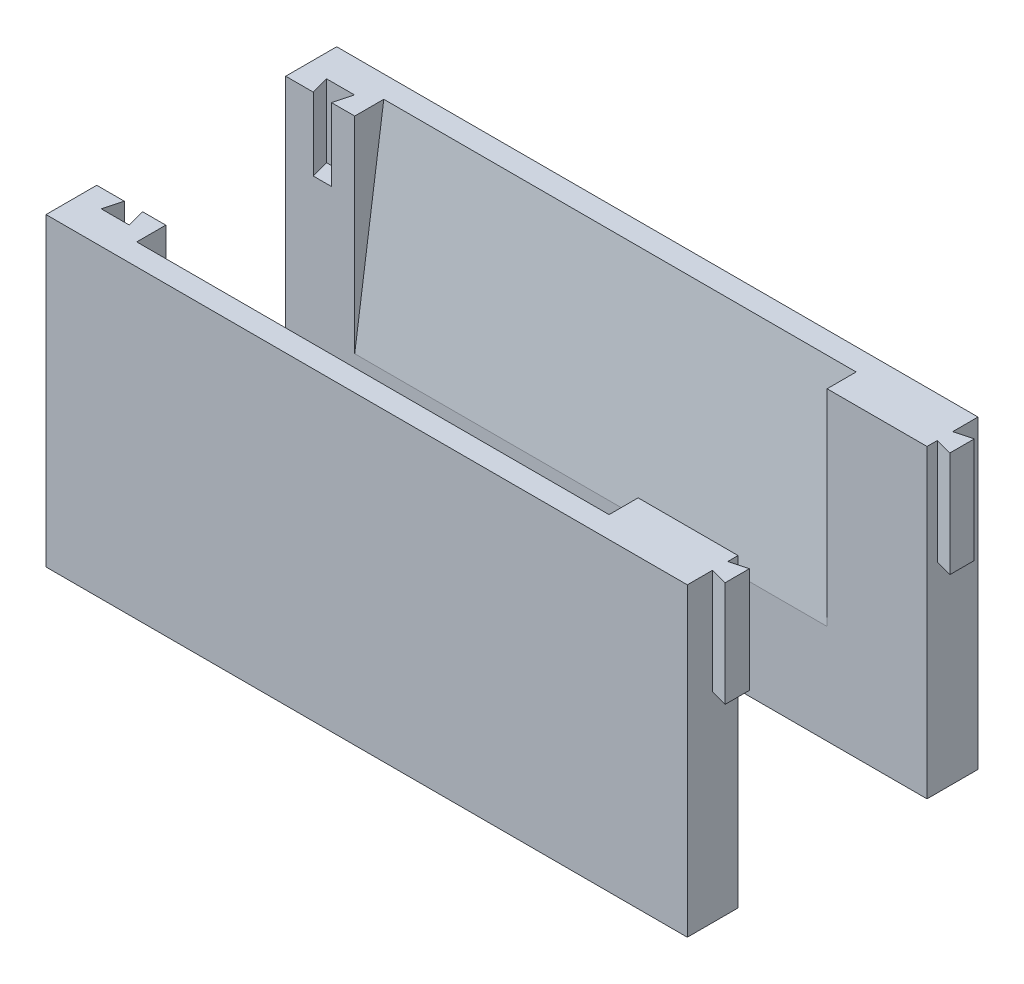
ISO-10303-21;
HEADER;
FILE_DESCRIPTION(('STEP AP214'),'2;1');
FILE_NAME('part.step','',(''),(''),'','','');
FILE_SCHEMA(('AUTOMOTIVE_DESIGN { 1 0 10303 214 1 1 1 1 }'));
ENDSEC;
DATA;
#1=APPLICATION_CONTEXT('core data for automotive mechanical design processes');
#2=APPLICATION_PROTOCOL_DEFINITION('international standard','automotive_design',2000,#1);
#3=PRODUCT_CONTEXT('',#1,'mechanical');
#4=PRODUCT('Part','Part','',(#3));
#5=PRODUCT_RELATED_PRODUCT_CATEGORY('part','',(#4));
#6=PRODUCT_DEFINITION_FORMATION('','',#4);
#7=PRODUCT_DEFINITION_CONTEXT('part definition',#1,'design');
#8=PRODUCT_DEFINITION('design','',#6,#7);
#9=PRODUCT_DEFINITION_SHAPE('','',#8);
#10=(LENGTH_UNIT() NAMED_UNIT(*) SI_UNIT(.MILLI.,.METRE.));
#11=(NAMED_UNIT(*) PLANE_ANGLE_UNIT() SI_UNIT($,.RADIAN.));
#12=(NAMED_UNIT(*) SI_UNIT($,.STERADIAN.) SOLID_ANGLE_UNIT());
#13=UNCERTAINTY_MEASURE_WITH_UNIT(LENGTH_MEASURE(1.E-05),#10,'distance_accuracy_value','');
#14=(GEOMETRIC_REPRESENTATION_CONTEXT(3) GLOBAL_UNCERTAINTY_ASSIGNED_CONTEXT((#13)) GLOBAL_UNIT_ASSIGNED_CONTEXT((#10,
#11,#12)) REPRESENTATION_CONTEXT('',''));
#15=CARTESIAN_POINT('',(0.,0.,0.));
#16=DIRECTION('',(0.,0.,1.));
#17=DIRECTION('',(1.,0.,0.));
#18=AXIS2_PLACEMENT_3D('',#15,#16,#17);
#19=CARTESIAN_POINT('',(0.,0.,-26.));
#20=DIRECTION('',(0.,0.,-1.));
#21=DIRECTION('',(1.,0.,0.));
#22=AXIS2_PLACEMENT_3D('',#19,#20,#21);
#23=PLANE('',#22);
#24=DIRECTION('',(0.,-1.,0.));
#25=VECTOR('',#24,1.);
#26=CARTESIAN_POINT('',(32.5489745050857,0.,-26.));
#27=LINE('',#26,#25);
#28=CARTESIAN_POINT('',(32.5489745050857,14.0482922625164,-26.));
#29=VERTEX_POINT('',#28);
#30=CARTESIAN_POINT('',(32.5489745050857,-14.2755129023587,-26.));
#31=VERTEX_POINT('',#30);
#32=EDGE_CURVE('E199',#29,#31,#27,.T.);
#33=ORIENTED_EDGE('',*,*,#32,.T.);
#34=DIRECTION('',(1.,0.,0.));
#35=VECTOR('',#34,1.);
#36=CARTESIAN_POINT('',(0.,-14.2755129023587,-26.));
#37=LINE('',#36,#35);
#38=CARTESIAN_POINT('',(-32.4510254949143,-14.2755129023587,-26.));
#39=VERTEX_POINT('',#38);
#40=EDGE_CURVE('E202',#39,#31,#37,.T.);
#41=ORIENTED_EDGE('',*,*,#40,.F.);
#42=DIRECTION('',(0.,-1.,0.));
#43=VECTOR('',#42,1.);
#44=CARTESIAN_POINT('',(-32.4510254949143,0.,-26.));
#45=LINE('',#44,#43);
#46=CARTESIAN_POINT('',(-32.4510254949143,14.0482922625164,-26.));
#47=VERTEX_POINT('',#46);
#48=EDGE_CURVE('E197',#47,#39,#45,.T.);
#49=ORIENTED_EDGE('',*,*,#48,.F.);
#50=DIRECTION('',(-1.,0.,0.));
#51=VECTOR('',#50,1.);
#52=CARTESIAN_POINT('',(-41.9510254949143,14.0482922625164,-26.));
#53=LINE('',#52,#51);
#54=CARTESIAN_POINT('',(-35.6510254949143,14.0482922625164,-26.));
#55=VERTEX_POINT('',#54);
#56=EDGE_CURVE('E269',#47,#55,#53,.T.);
#57=ORIENTED_EDGE('',*,*,#56,.T.);
#58=DIRECTION('',(0.,-1.,0.));
#59=VECTOR('',#58,1.);
#60=CARTESIAN_POINT('',(-35.6510254949143,188.876376348919,-26.));
#61=LINE('',#60,#59);
#62=CARTESIAN_POINT('',(-35.6510254949143,4.04829226251643,-26.));
#63=VERTEX_POINT('',#62);
#64=EDGE_CURVE('E252',#55,#63,#61,.T.);
#65=ORIENTED_EDGE('',*,*,#64,.T.);
#66=DIRECTION('',(-1.,0.,0.));
#67=VECTOR('',#66,1.);
#68=CARTESIAN_POINT('',(-41.9510254949143,4.04829226251643,-26.));
#69=LINE('',#68,#67);
#70=CARTESIAN_POINT('',(-38.1510254949143,4.04829226251643,-26.));
#71=VERTEX_POINT('',#70);
#72=EDGE_CURVE('E224',#63,#71,#69,.T.);
#73=ORIENTED_EDGE('',*,*,#72,.T.);
#74=DIRECTION('',(0.,-1.,0.));
#75=VECTOR('',#74,1.);
#76=CARTESIAN_POINT('',(-38.1510254949143,188.876376348919,-26.));
#77=LINE('',#76,#75);
#78=CARTESIAN_POINT('',(-38.1510254949143,14.0482922625164,-26.));
#79=VERTEX_POINT('',#78);
#80=EDGE_CURVE('E233',#79,#71,#77,.T.);
#81=ORIENTED_EDGE('',*,*,#80,.F.);
#82=CARTESIAN_POINT('',(-41.9510254949143,14.0482922625164,-26.));
#83=VERTEX_POINT('',#82);
#84=EDGE_CURVE('E267',#79,#83,#53,.T.);
#85=ORIENTED_EDGE('',*,*,#84,.T.);
#86=DIRECTION('',(0.,-1.,0.));
#87=VECTOR('',#86,1.);
#88=CARTESIAN_POINT('',(-41.9510254949143,14.0482922625164,-26.));
#89=LINE('',#88,#87);
#90=CARTESIAN_POINT('',(-41.9510254949143,-27.9517077374836,-26.));
#91=VERTEX_POINT('',#90);
#92=EDGE_CURVE('E162',#83,#91,#89,.T.);
#93=ORIENTED_EDGE('',*,*,#92,.T.);
#94=DIRECTION('',(1.,0.,0.));
#95=VECTOR('',#94,1.);
#96=CARTESIAN_POINT('',(-41.9510254949143,-27.9517077374836,-26.));
#97=LINE('',#96,#95);
#98=CARTESIAN_POINT('',(46.2989745050857,-27.9517077374836,-26.));
#99=VERTEX_POINT('',#98);
#100=EDGE_CURVE('E261',#91,#99,#97,.T.);
#101=ORIENTED_EDGE('',*,*,#100,.T.);
#102=DIRECTION('',(0.,1.,0.));
#103=VECTOR('',#102,1.);
#104=CARTESIAN_POINT('',(46.2989745050857,14.0482922625164,-26.));
#105=LINE('',#104,#103);
#106=CARTESIAN_POINT('',(46.2989745050857,14.0482922625164,-26.));
#107=VERTEX_POINT('',#106);
#108=EDGE_CURVE('E264',#99,#107,#105,.T.);
#109=ORIENTED_EDGE('',*,*,#108,.T.);
#110=EDGE_CURVE('E168',#107,#29,#53,.T.);
#111=ORIENTED_EDGE('',*,*,#110,.T.);
#112=EDGE_LOOP('',(#33,#41,#49,#57,#65,#73,#81,#85,#93,#101,#109,#111));
#113=FACE_BOUND('',#112,.T.);
#114=ADVANCED_FACE('F49',(#113),#23,.F.);
#115=CARTESIAN_POINT('',(-41.9510254949143,14.0482922625164,-31.));
#116=DIRECTION('',(0.,-1.,0.));
#117=DIRECTION('',(0.,0.,1.));
#118=AXIS2_PLACEMENT_3D('',#115,#116,#117);
#119=PLANE('',#118);
#120=DIRECTION('',(0.,0.,1.));
#121=VECTOR('',#120,1.);
#122=CARTESIAN_POINT('',(32.5489745050857,14.0482922625164,-26.));
#123=LINE('',#122,#121);
#124=CARTESIAN_POINT('',(32.5489745050857,14.0482922625164,-30.));
#125=VERTEX_POINT('',#124);
#126=EDGE_CURVE('E191',#125,#29,#123,.T.);
#127=ORIENTED_EDGE('',*,*,#126,.T.);
#128=ORIENTED_EDGE('',*,*,#110,.F.);
#129=DIRECTION('',(0.,0.,1.));
#130=VECTOR('',#129,1.);
#131=CARTESIAN_POINT('',(46.2989745050857,14.0482922625164,-31.));
#132=LINE('',#131,#130);
#133=CARTESIAN_POINT('',(46.2989745050857,14.0482922625164,-27.42));
#134=VERTEX_POINT('',#133);
#135=EDGE_CURVE('E167',#134,#107,#132,.T.);
#136=ORIENTED_EDGE('',*,*,#135,.F.);
#137=DIRECTION('',(-0.965925826289067,0.,-0.258819045102525));
#138=VECTOR('',#137,1.);
#139=CARTESIAN_POINT('',(48.6489745050857,14.0482922625164,-26.7903193977868));
#140=LINE('',#139,#138);
#141=CARTESIAN_POINT('',(48.6489745050857,14.0482922625164,-26.7903193977868));
#142=VERTEX_POINT('',#141);
#143=EDGE_CURVE('E210',#142,#134,#140,.T.);
#144=ORIENTED_EDGE('',*,*,#143,.F.);
#145=DIRECTION('',(0.,0.,1.));
#146=VECTOR('',#145,1.);
#147=CARTESIAN_POINT('',(48.6489745050857,14.0482922625164,-30.1496806022131));
#148=LINE('',#147,#146);
#149=CARTESIAN_POINT('',(48.6489745050857,14.0482922625164,-30.1496806022131));
#150=VERTEX_POINT('',#149);
#151=EDGE_CURVE('E217',#150,#142,#148,.T.);
#152=ORIENTED_EDGE('',*,*,#151,.F.);
#153=DIRECTION('',(0.965925826289067,0.,-0.258819045102525));
#154=VECTOR('',#153,1.);
#155=CARTESIAN_POINT('',(46.2989745050857,14.0482922625164,-29.52));
#156=LINE('',#155,#154);
#157=CARTESIAN_POINT('',(46.2989745050857,14.0482922625164,-29.52));
#158=VERTEX_POINT('',#157);
#159=EDGE_CURVE('E205',#158,#150,#156,.T.);
#160=ORIENTED_EDGE('',*,*,#159,.F.);
#161=CARTESIAN_POINT('',(46.2989745050857,14.0482922625164,-33.0175));
#162=VERTEX_POINT('',#161);
#163=EDGE_CURVE('E181',#162,#158,#132,.T.);
#164=ORIENTED_EDGE('',*,*,#163,.F.);
#165=DIRECTION('',(-1.,0.,0.));
#166=VECTOR('',#165,1.);
#167=CARTESIAN_POINT('',(-41.9510254949143,14.0482922625164,-33.0175));
#168=LINE('',#167,#166);
#169=CARTESIAN_POINT('',(-41.9510254949143,14.0482922625164,-33.0175));
#170=VERTEX_POINT('',#169);
#171=EDGE_CURVE('E174',#162,#170,#168,.T.);
#172=ORIENTED_EDGE('',*,*,#171,.T.);
#173=DIRECTION('',(0.,0.,1.));
#174=VECTOR('',#173,1.);
#175=CARTESIAN_POINT('',(-41.9510254949143,14.0482922625164,-31.));
#176=LINE('',#175,#174);
#177=EDGE_CURVE('E157',#170,#83,#176,.T.);
#178=ORIENTED_EDGE('',*,*,#177,.T.);
#179=ORIENTED_EDGE('',*,*,#84,.F.);
#180=DIRECTION('',(0.258819045102517,0.,0.965925826289069));
#181=VECTOR('',#180,1.);
#182=CARTESIAN_POINT('',(-38.1510254949143,14.0482922625164,-26.));
#183=LINE('',#182,#181);
#184=CARTESIAN_POINT('',(-38.8208984759921,14.0482922625164,-28.5));
#185=VERTEX_POINT('',#184);
#186=EDGE_CURVE('E237',#185,#79,#183,.T.);
#187=ORIENTED_EDGE('',*,*,#186,.F.);
#188=DIRECTION('',(-1.,0.,0.));
#189=VECTOR('',#188,1.);
#190=CARTESIAN_POINT('',(-38.8208984759921,14.0482922625164,-28.5));
#191=LINE('',#190,#189);
#192=CARTESIAN_POINT('',(-34.9811525138365,14.0482922625164,-28.5));
#193=VERTEX_POINT('',#192);
#194=EDGE_CURVE('E243',#193,#185,#191,.T.);
#195=ORIENTED_EDGE('',*,*,#194,.F.);
#196=DIRECTION('',(0.258819045102517,0.,-0.965925826289069));
#197=VECTOR('',#196,1.);
#198=CARTESIAN_POINT('',(-34.9811525138365,14.0482922625164,-28.5));
#199=LINE('',#198,#197);
#200=EDGE_CURVE('E240',#55,#193,#199,.T.);
#201=ORIENTED_EDGE('',*,*,#200,.F.);
#202=ORIENTED_EDGE('',*,*,#56,.F.);
#203=DIRECTION('',(0.,0.,1.));
#204=VECTOR('',#203,1.);
#205=CARTESIAN_POINT('',(-32.4510254949143,14.0482922625164,-26.));
#206=LINE('',#205,#204);
#207=CARTESIAN_POINT('',(-32.4510254949143,14.0482922625164,-30.));
#208=VERTEX_POINT('',#207);
#209=EDGE_CURVE('E64',#208,#47,#206,.T.);
#210=ORIENTED_EDGE('',*,*,#209,.F.);
#211=DIRECTION('',(-1.,0.,0.));
#212=VECTOR('',#211,1.);
#213=CARTESIAN_POINT('',(32.5489745050857,14.0482922625164,-30.));
#214=LINE('',#213,#212);
#215=EDGE_CURVE('E192',#125,#208,#214,.T.);
#216=ORIENTED_EDGE('',*,*,#215,.F.);
#217=EDGE_LOOP('',(#127,#128,#136,#144,#152,#160,#164,#172,#178,#179,#187,#195,#201,#202,#210,#216));
#218=FACE_BOUND('',#217,.T.);
#219=ADVANCED_FACE('F179',(#218),#119,.F.);
#220=CARTESIAN_POINT('',(46.2989745050857,14.0482922625164,-31.));
#221=DIRECTION('',(-1.,0.,0.));
#222=DIRECTION('',(0.,0.,-1.));
#223=AXIS2_PLACEMENT_3D('',#220,#221,#222);
#224=PLANE('',#223);
#225=DIRECTION('',(0.,1.,0.));
#226=VECTOR('',#225,1.);
#227=CARTESIAN_POINT('',(46.2989745050857,-0.451707737483568,-27.42));
#228=LINE('',#227,#226);
#229=CARTESIAN_POINT('',(46.2989745050857,-0.451707737483568,-27.42));
#230=VERTEX_POINT('',#229);
#231=EDGE_CURVE('E222',#230,#134,#228,.T.);
#232=ORIENTED_EDGE('',*,*,#231,.T.);
#233=ORIENTED_EDGE('',*,*,#135,.T.);
#234=ORIENTED_EDGE('',*,*,#108,.F.);
#235=DIRECTION('',(0.,0.,1.));
#236=VECTOR('',#235,1.);
#237=CARTESIAN_POINT('',(46.2989745050857,-27.9517077374836,-31.));
#238=LINE('',#237,#236);
#239=CARTESIAN_POINT('',(46.2989745050857,-27.9517077374836,-33.0175));
#240=VERTEX_POINT('',#239);
#241=EDGE_CURVE('E57',#240,#99,#238,.T.);
#242=ORIENTED_EDGE('',*,*,#241,.F.);
#243=DIRECTION('',(0.,1.,0.));
#244=VECTOR('',#243,1.);
#245=CARTESIAN_POINT('',(46.2989745050857,-27.9517077374836,-33.0175));
#246=LINE('',#245,#244);
#247=EDGE_CURVE('E177',#240,#162,#246,.T.);
#248=ORIENTED_EDGE('',*,*,#247,.T.);
#249=ORIENTED_EDGE('',*,*,#163,.T.);
#250=DIRECTION('',(0.,1.,0.));
#251=VECTOR('',#250,1.);
#252=CARTESIAN_POINT('',(46.2989745050857,-0.451707737483568,-29.52));
#253=LINE('',#252,#251);
#254=CARTESIAN_POINT('',(46.2989745050857,-0.451707737483568,-29.52));
#255=VERTEX_POINT('',#254);
#256=EDGE_CURVE('E72',#255,#158,#253,.T.);
#257=ORIENTED_EDGE('',*,*,#256,.F.);
#258=DIRECTION('',(0.,0.,-1.));
#259=VECTOR('',#258,1.);
#260=CARTESIAN_POINT('',(46.2989745050857,-0.451707737483568,-27.42));
#261=LINE('',#260,#259);
#262=EDGE_CURVE('E206',#230,#255,#261,.T.);
#263=ORIENTED_EDGE('',*,*,#262,.F.);
#264=EDGE_LOOP('',(#232,#233,#234,#242,#248,#249,#257,#263));
#265=FACE_BOUND('',#264,.T.);
#266=ADVANCED_FACE('F276',(#265),#224,.F.);
#267=CARTESIAN_POINT('',(-41.9510254949143,14.0482922625164,-31.));
#268=DIRECTION('',(1.,0.,0.));
#269=DIRECTION('',(0.,0.,1.));
#270=AXIS2_PLACEMENT_3D('',#267,#268,#269);
#271=PLANE('',#270);
#272=ORIENTED_EDGE('',*,*,#92,.F.);
#273=ORIENTED_EDGE('',*,*,#177,.F.);
#274=DIRECTION('',(0.,1.,0.));
#275=VECTOR('',#274,1.);
#276=CARTESIAN_POINT('',(-41.9510254949143,-27.9517077374836,-33.0175));
#277=LINE('',#276,#275);
#278=CARTESIAN_POINT('',(-41.9510254949143,-27.9517077374836,-33.0175));
#279=VERTEX_POINT('',#278);
#280=EDGE_CURVE('E159',#279,#170,#277,.T.);
#281=ORIENTED_EDGE('',*,*,#280,.F.);
#282=DIRECTION('',(0.,0.,1.));
#283=VECTOR('',#282,1.);
#284=CARTESIAN_POINT('',(-41.9510254949143,-27.9517077374836,-31.));
#285=LINE('',#284,#283);
#286=EDGE_CURVE('E12',#279,#91,#285,.T.);
#287=ORIENTED_EDGE('',*,*,#286,.T.);
#288=EDGE_LOOP('',(#272,#273,#281,#287));
#289=FACE_BOUND('',#288,.T.);
#290=ADVANCED_FACE('F51',(#289),#271,.F.);
#291=CARTESIAN_POINT('',(-41.9510254949143,-27.9517077374836,-31.));
#292=DIRECTION('',(0.,1.,0.));
#293=DIRECTION('',(0.,0.,-1.));
#294=AXIS2_PLACEMENT_3D('',#291,#292,#293);
#295=PLANE('',#294);
#296=ORIENTED_EDGE('',*,*,#100,.F.);
#297=ORIENTED_EDGE('',*,*,#286,.F.);
#298=DIRECTION('',(-1.,0.,0.));
#299=VECTOR('',#298,1.);
#300=CARTESIAN_POINT('',(-41.9510254949143,-27.9517077374836,-33.0175));
#301=LINE('',#300,#299);
#302=EDGE_CURVE('E176',#240,#279,#301,.T.);
#303=ORIENTED_EDGE('',*,*,#302,.F.);
#304=ORIENTED_EDGE('',*,*,#241,.T.);
#305=EDGE_LOOP('',(#296,#297,#303,#304));
#306=FACE_BOUND('',#305,.T.);
#307=ADVANCED_FACE('F274',(#306),#295,.F.);
#308=CARTESIAN_POINT('',(-34.9811525138365,188.876376348919,-28.5));
#309=DIRECTION('',(-0.965925826289069,0.,-0.258819045102517));
#310=DIRECTION('',(0.258819045102517,0.,-0.965925826289069));
#311=AXIS2_PLACEMENT_3D('',#308,#309,#310);
#312=PLANE('',#311);
#313=ORIENTED_EDGE('',*,*,#200,.T.);
#314=DIRECTION('',(0.,-1.,0.));
#315=VECTOR('',#314,1.);
#316=CARTESIAN_POINT('',(-34.9811525138365,188.876376348919,-28.5));
#317=LINE('',#316,#315);
#318=CARTESIAN_POINT('',(-34.9811525138365,4.04829226251643,-28.5));
#319=VERTEX_POINT('',#318);
#320=EDGE_CURVE('E255',#193,#319,#317,.T.);
#321=ORIENTED_EDGE('',*,*,#320,.T.);
#322=DIRECTION('',(0.258819045102517,0.,-0.965925826289069));
#323=VECTOR('',#322,1.);
#324=CARTESIAN_POINT('',(-34.9811525138365,4.04829226251643,-28.5));
#325=LINE('',#324,#323);
#326=EDGE_CURVE('E230',#63,#319,#325,.T.);
#327=ORIENTED_EDGE('',*,*,#326,.F.);
#328=ORIENTED_EDGE('',*,*,#64,.F.);
#329=EDGE_LOOP('',(#313,#321,#327,#328));
#330=FACE_BOUND('',#329,.T.);
#331=ADVANCED_FACE('F289',(#330),#312,.T.);
#332=CARTESIAN_POINT('',(-38.8208984759921,188.876376348919,-28.5));
#333=DIRECTION('',(0.,0.,1.));
#334=DIRECTION('',(-1.,0.,0.));
#335=AXIS2_PLACEMENT_3D('',#332,#333,#334);
#336=PLANE('',#335);
#337=ORIENTED_EDGE('',*,*,#194,.T.);
#338=DIRECTION('',(0.,-1.,0.));
#339=VECTOR('',#338,1.);
#340=CARTESIAN_POINT('',(-38.8208984759921,188.876376348919,-28.5));
#341=LINE('',#340,#339);
#342=CARTESIAN_POINT('',(-38.8208984759921,4.04829226251643,-28.5));
#343=VERTEX_POINT('',#342);
#344=EDGE_CURVE('E249',#185,#343,#341,.T.);
#345=ORIENTED_EDGE('',*,*,#344,.T.);
#346=DIRECTION('',(-1.,0.,0.));
#347=VECTOR('',#346,1.);
#348=CARTESIAN_POINT('',(-38.8208984759921,4.04829226251643,-28.5));
#349=LINE('',#348,#347);
#350=EDGE_CURVE('E234',#319,#343,#349,.T.);
#351=ORIENTED_EDGE('',*,*,#350,.F.);
#352=ORIENTED_EDGE('',*,*,#320,.F.);
#353=EDGE_LOOP('',(#337,#345,#351,#352));
#354=FACE_BOUND('',#353,.T.);
#355=ADVANCED_FACE('F296',(#354),#336,.T.);
#356=CARTESIAN_POINT('',(-38.1510254949143,188.876376348919,-26.));
#357=DIRECTION('',(0.965925826289069,0.,-0.258819045102517));
#358=DIRECTION('',(0.258819045102517,0.,0.965925826289069));
#359=AXIS2_PLACEMENT_3D('',#356,#357,#358);
#360=PLANE('',#359);
#361=ORIENTED_EDGE('',*,*,#186,.T.);
#362=ORIENTED_EDGE('',*,*,#80,.T.);
#363=DIRECTION('',(0.258819045102517,0.,0.965925826289069));
#364=VECTOR('',#363,1.);
#365=CARTESIAN_POINT('',(-38.1510254949143,4.04829226251643,-26.));
#366=LINE('',#365,#364);
#367=EDGE_CURVE('E235',#343,#71,#366,.T.);
#368=ORIENTED_EDGE('',*,*,#367,.F.);
#369=ORIENTED_EDGE('',*,*,#344,.F.);
#370=EDGE_LOOP('',(#361,#362,#368,#369));
#371=FACE_BOUND('',#370,.T.);
#372=ADVANCED_FACE('F294',(#371),#360,.T.);
#373=CARTESIAN_POINT('',(-41.9510254949143,4.04829226251643,-31.));
#374=DIRECTION('',(0.,-1.,0.));
#375=DIRECTION('',(0.,0.,1.));
#376=AXIS2_PLACEMENT_3D('',#373,#374,#375);
#377=PLANE('',#376);
#378=ORIENTED_EDGE('',*,*,#72,.F.);
#379=ORIENTED_EDGE('',*,*,#326,.T.);
#380=ORIENTED_EDGE('',*,*,#350,.T.);
#381=ORIENTED_EDGE('',*,*,#367,.T.);
#382=EDGE_LOOP('',(#378,#379,#380,#381));
#383=FACE_BOUND('',#382,.T.);
#384=ADVANCED_FACE('F292',(#383),#377,.F.);
#385=CARTESIAN_POINT('',(48.6489745050857,-0.451707737483568,-26.7903193977868));
#386=DIRECTION('',(-0.258819045102525,0.,0.965925826289067));
#387=DIRECTION('',(-0.965925826289067,0.,-0.258819045102525));
#388=AXIS2_PLACEMENT_3D('',#385,#386,#387);
#389=PLANE('',#388);
#390=ORIENTED_EDGE('',*,*,#143,.T.);
#391=ORIENTED_EDGE('',*,*,#231,.F.);
#392=DIRECTION('',(-0.965925826289067,0.,-0.258819045102525));
#393=VECTOR('',#392,1.);
#394=CARTESIAN_POINT('',(48.6489745050857,-0.451707737483568,-26.7903193977868));
#395=LINE('',#394,#393);
#396=CARTESIAN_POINT('',(48.6489745050857,-0.451707737483568,-26.7903193977868));
#397=VERTEX_POINT('',#396);
#398=EDGE_CURVE('E214',#397,#230,#395,.T.);
#399=ORIENTED_EDGE('',*,*,#398,.F.);
#400=DIRECTION('',(0.,1.,0.));
#401=VECTOR('',#400,1.);
#402=CARTESIAN_POINT('',(48.6489745050857,-0.451707737483568,-26.7903193977868));
#403=LINE('',#402,#401);
#404=EDGE_CURVE('E225',#397,#142,#403,.T.);
#405=ORIENTED_EDGE('',*,*,#404,.T.);
#406=EDGE_LOOP('',(#390,#391,#399,#405));
#407=FACE_BOUND('',#406,.T.);
#408=ADVANCED_FACE('F393',(#407),#389,.T.);
#409=CARTESIAN_POINT('',(48.6489745050857,-0.451707737483568,-30.1496806022131));
#410=DIRECTION('',(1.,0.,0.));
#411=DIRECTION('',(0.,0.,1.));
#412=AXIS2_PLACEMENT_3D('',#409,#410,#411);
#413=PLANE('',#412);
#414=ORIENTED_EDGE('',*,*,#151,.T.);
#415=ORIENTED_EDGE('',*,*,#404,.F.);
#416=DIRECTION('',(0.,0.,1.));
#417=VECTOR('',#416,1.);
#418=CARTESIAN_POINT('',(48.6489745050857,-0.451707737483568,-30.1496806022131));
#419=LINE('',#418,#417);
#420=CARTESIAN_POINT('',(48.6489745050857,-0.451707737483568,-30.1496806022131));
#421=VERTEX_POINT('',#420);
#422=EDGE_CURVE('E212',#421,#397,#419,.T.);
#423=ORIENTED_EDGE('',*,*,#422,.F.);
#424=DIRECTION('',(0.,1.,0.));
#425=VECTOR('',#424,1.);
#426=CARTESIAN_POINT('',(48.6489745050857,-0.451707737483568,-30.1496806022131));
#427=LINE('',#426,#425);
#428=EDGE_CURVE('E227',#421,#150,#427,.T.);
#429=ORIENTED_EDGE('',*,*,#428,.T.);
#430=EDGE_LOOP('',(#414,#415,#423,#429));
#431=FACE_BOUND('',#430,.T.);
#432=ADVANCED_FACE('F383',(#431),#413,.T.);
#433=CARTESIAN_POINT('',(46.2989745050857,-0.451707737483568,-29.52));
#434=DIRECTION('',(-0.258819045102525,0.,-0.965925826289067));
#435=DIRECTION('',(0.965925826289067,0.,-0.258819045102525));
#436=AXIS2_PLACEMENT_3D('',#433,#434,#435);
#437=PLANE('',#436);
#438=ORIENTED_EDGE('',*,*,#159,.T.);
#439=ORIENTED_EDGE('',*,*,#428,.F.);
#440=DIRECTION('',(0.965925826289067,0.,-0.258819045102525));
#441=VECTOR('',#440,1.);
#442=CARTESIAN_POINT('',(46.2989745050857,-0.451707737483568,-29.52));
#443=LINE('',#442,#441);
#444=EDGE_CURVE('E209',#255,#421,#443,.T.);
#445=ORIENTED_EDGE('',*,*,#444,.F.);
#446=ORIENTED_EDGE('',*,*,#256,.T.);
#447=EDGE_LOOP('',(#438,#439,#445,#446));
#448=FACE_BOUND('',#447,.T.);
#449=ADVANCED_FACE('F372',(#448),#437,.T.);
#450=CARTESIAN_POINT('',(0.,-0.451707737483568,-26.));
#451=DIRECTION('',(0.,1.,0.));
#452=DIRECTION('',(0.,0.,-1.));
#453=AXIS2_PLACEMENT_3D('',#450,#451,#452);
#454=PLANE('',#453);
#455=ORIENTED_EDGE('',*,*,#262,.T.);
#456=ORIENTED_EDGE('',*,*,#444,.T.);
#457=ORIENTED_EDGE('',*,*,#422,.T.);
#458=ORIENTED_EDGE('',*,*,#398,.T.);
#459=EDGE_LOOP('',(#455,#456,#457,#458));
#460=FACE_BOUND('',#459,.T.);
#461=ADVANCED_FACE('F361',(#460),#454,.F.);
#462=CARTESIAN_POINT('',(32.5489745050857,14.0482922625164,-30.));
#463=DIRECTION('',(0.,-0.139836384000341,-0.990174623846577));
#464=DIRECTION('',(0.,-0.990174623846577,0.139836384000341));
#465=AXIS2_PLACEMENT_3D('',#462,#463,#464);
#466=PLANE('',#465);
#467=DIRECTION('',(0.,0.990174623846576,-0.139836384000341));
#468=VECTOR('',#467,1.);
#469=CARTESIAN_POINT('',(-32.4510254949143,14.0482922625164,-30.));
#470=LINE('',#469,#468);
#471=EDGE_CURVE('E183',#39,#208,#470,.T.);
#472=ORIENTED_EDGE('',*,*,#471,.F.);
#473=ORIENTED_EDGE('',*,*,#40,.T.);
#474=DIRECTION('',(0.,0.990174623846576,-0.139836384000341));
#475=VECTOR('',#474,1.);
#476=CARTESIAN_POINT('',(32.5489745050857,14.0482922625164,-30.));
#477=LINE('',#476,#475);
#478=EDGE_CURVE('E189',#31,#125,#477,.T.);
#479=ORIENTED_EDGE('',*,*,#478,.T.);
#480=ORIENTED_EDGE('',*,*,#215,.T.);
#481=EDGE_LOOP('',(#472,#473,#479,#480));
#482=FACE_BOUND('',#481,.T.);
#483=ADVANCED_FACE('F350',(#482),#466,.F.);
#484=CARTESIAN_POINT('',(32.5489745050857,0.,-26.));
#485=DIRECTION('',(-1.,0.,0.));
#486=DIRECTION('',(0.,0.,-1.));
#487=AXIS2_PLACEMENT_3D('',#484,#485,#486);
#488=PLANE('',#487);
#489=ORIENTED_EDGE('',*,*,#32,.F.);
#490=ORIENTED_EDGE('',*,*,#126,.F.);
#491=ORIENTED_EDGE('',*,*,#478,.F.);
#492=EDGE_LOOP('',(#489,#490,#491));
#493=FACE_BOUND('',#492,.T.);
#494=ADVANCED_FACE('F339',(#493),#488,.T.);
#495=CARTESIAN_POINT('',(-32.4510254949143,0.,-26.));
#496=DIRECTION('',(-1.,0.,0.));
#497=DIRECTION('',(0.,0.,-1.));
#498=AXIS2_PLACEMENT_3D('',#495,#496,#497);
#499=PLANE('',#498);
#500=ORIENTED_EDGE('',*,*,#209,.T.);
#501=ORIENTED_EDGE('',*,*,#48,.T.);
#502=ORIENTED_EDGE('',*,*,#471,.T.);
#503=EDGE_LOOP('',(#500,#501,#502));
#504=FACE_BOUND('',#503,.T.);
#505=ADVANCED_FACE('F335',(#504),#499,.F.);
#506=CARTESIAN_POINT('',(-41.9510254949143,-27.9517077374836,-33.0175));
#507=DIRECTION('',(0.,0.,-1.));
#508=DIRECTION('',(-1.,0.,0.));
#509=AXIS2_PLACEMENT_3D('',#506,#507,#508);
#510=PLANE('',#509);
#511=ORIENTED_EDGE('',*,*,#171,.F.);
#512=ORIENTED_EDGE('',*,*,#247,.F.);
#513=ORIENTED_EDGE('',*,*,#302,.T.);
#514=ORIENTED_EDGE('',*,*,#280,.T.);
#515=EDGE_LOOP('',(#511,#512,#513,#514));
#516=FACE_BOUND('',#515,.T.);
#517=ADVANCED_FACE('F172',(#516),#510,.T.);
#518=CLOSED_SHELL('',(#114,#219,#266,#290,#307,#331,#355,#372,#384,#408,#432,#449,#461,#483,
#494,#505,#517));
#519=MANIFOLD_SOLID_BREP('B2',#518);
#520=CARTESIAN_POINT('',(0.,0.,0.));
#521=DIRECTION('',(0.,0.,1.));
#522=DIRECTION('',(1.,0.,0.));
#523=AXIS2_PLACEMENT_3D('',#520,#521,#522);
#524=PLANE('',#523);
#525=DIRECTION('',(0.,-1.,0.));
#526=VECTOR('',#525,1.);
#527=CARTESIAN_POINT('',(32.5489745050857,0.,0.));
#528=LINE('',#527,#526);
#529=CARTESIAN_POINT('',(32.5489745050857,14.0482922625164,0.));
#530=VERTEX_POINT('',#529);
#531=CARTESIAN_POINT('',(32.5489745050857,-14.2755129023587,0.));
#532=VERTEX_POINT('',#531);
#533=EDGE_CURVE('E650',#530,#532,#528,.T.);
#534=ORIENTED_EDGE('',*,*,#533,.F.);
#535=DIRECTION('',(-1.,0.,0.));
#536=VECTOR('',#535,1.);
#537=CARTESIAN_POINT('',(-41.9510254949143,14.0482922625164,0.));
#538=LINE('',#537,#536);
#539=CARTESIAN_POINT('',(46.2989745050857,14.0482922625164,0.));
#540=VERTEX_POINT('',#539);
#541=EDGE_CURVE('E720',#540,#530,#538,.T.);
#542=ORIENTED_EDGE('',*,*,#541,.F.);
#543=DIRECTION('',(0.,1.,0.));
#544=VECTOR('',#543,1.);
#545=CARTESIAN_POINT('',(46.2989745050857,14.0482922625164,0.));
#546=LINE('',#545,#544);
#547=CARTESIAN_POINT('',(46.2989745050857,-27.9517077374836,0.));
#548=VERTEX_POINT('',#547);
#549=EDGE_CURVE('E716',#548,#540,#546,.T.);
#550=ORIENTED_EDGE('',*,*,#549,.F.);
#551=DIRECTION('',(1.,0.,0.));
#552=VECTOR('',#551,1.);
#553=CARTESIAN_POINT('',(-41.9510254949143,-27.9517077374836,0.));
#554=LINE('',#553,#552);
#555=CARTESIAN_POINT('',(-41.9510254949143,-27.9517077374836,0.));
#556=VERTEX_POINT('',#555);
#557=EDGE_CURVE('E714',#556,#548,#554,.T.);
#558=ORIENTED_EDGE('',*,*,#557,.F.);
#559=DIRECTION('',(0.,-1.,0.));
#560=VECTOR('',#559,1.);
#561=CARTESIAN_POINT('',(-41.9510254949143,14.0482922625164,0.));
#562=LINE('',#561,#560);
#563=CARTESIAN_POINT('',(-41.9510254949143,14.0482922625164,0.));
#564=VERTEX_POINT('',#563);
#565=EDGE_CURVE('E619',#564,#556,#562,.T.);
#566=ORIENTED_EDGE('',*,*,#565,.F.);
#567=CARTESIAN_POINT('',(-38.1510254949143,14.0482922625164,0.));
#568=VERTEX_POINT('',#567);
#569=EDGE_CURVE('E719',#568,#564,#538,.T.);
#570=ORIENTED_EDGE('',*,*,#569,.F.);
#571=DIRECTION('',(0.,-1.,0.));
#572=VECTOR('',#571,1.);
#573=CARTESIAN_POINT('',(-38.1510254949143,188.876376348919,0.));
#574=LINE('',#573,#572);
#575=CARTESIAN_POINT('',(-38.1510254949143,4.04829226251643,0.));
#576=VERTEX_POINT('',#575);
#577=EDGE_CURVE('E686',#568,#576,#574,.T.);
#578=ORIENTED_EDGE('',*,*,#577,.T.);
#579=DIRECTION('',(-1.,0.,0.));
#580=VECTOR('',#579,1.);
#581=CARTESIAN_POINT('',(-41.9510254949143,4.04829226251643,0.));
#582=LINE('',#581,#580);
#583=CARTESIAN_POINT('',(-35.6510254949143,4.04829226251643,0.));
#584=VERTEX_POINT('',#583);
#585=EDGE_CURVE('E677',#584,#576,#582,.T.);
#586=ORIENTED_EDGE('',*,*,#585,.F.);
#587=DIRECTION('',(0.,-1.,0.));
#588=VECTOR('',#587,1.);
#589=CARTESIAN_POINT('',(-35.6510254949143,188.876376348919,0.));
#590=LINE('',#589,#588);
#591=CARTESIAN_POINT('',(-35.6510254949143,14.0482922625164,0.));
#592=VERTEX_POINT('',#591);
#593=EDGE_CURVE('E707',#592,#584,#590,.T.);
#594=ORIENTED_EDGE('',*,*,#593,.F.);
#595=CARTESIAN_POINT('',(-32.4510254949143,14.0482922625164,0.));
#596=VERTEX_POINT('',#595);
#597=EDGE_CURVE('E724',#596,#592,#538,.T.);
#598=ORIENTED_EDGE('',*,*,#597,.F.);
#599=DIRECTION('',(0.,-1.,0.));
#600=VECTOR('',#599,1.);
#601=CARTESIAN_POINT('',(-32.4510254949143,0.,0.));
#602=LINE('',#601,#600);
#603=CARTESIAN_POINT('',(-32.4510254949143,-14.2755129023587,0.));
#604=VERTEX_POINT('',#603);
#605=EDGE_CURVE('E520',#596,#604,#602,.T.);
#606=ORIENTED_EDGE('',*,*,#605,.T.);
#607=DIRECTION('',(1.,0.,0.));
#608=VECTOR('',#607,1.);
#609=CARTESIAN_POINT('',(0.,-14.2755129023587,0.));
#610=LINE('',#609,#608);
#611=EDGE_CURVE('E652',#604,#532,#610,.T.);
#612=ORIENTED_EDGE('',*,*,#611,.T.);
#613=EDGE_LOOP('',(#534,#542,#550,#558,#566,#570,#578,#586,#594,#598,#606,#612));
#614=FACE_BOUND('',#613,.T.);
#615=ADVANCED_FACE('F505',(#614),#524,.F.);
#616=CARTESIAN_POINT('',(-41.9510254949143,14.0482922625164,5.));
#617=DIRECTION('',(0.,-1.,0.));
#618=DIRECTION('',(0.,0.,-1.));
#619=AXIS2_PLACEMENT_3D('',#616,#617,#618);
#620=PLANE('',#619);
#621=DIRECTION('',(0.,0.,-1.));
#622=VECTOR('',#621,1.);
#623=CARTESIAN_POINT('',(32.5489745050857,14.0482922625164,0.));
#624=LINE('',#623,#622);
#625=CARTESIAN_POINT('',(32.5489745050857,14.0482922625164,4.));
#626=VERTEX_POINT('',#625);
#627=EDGE_CURVE('E641',#626,#530,#624,.T.);
#628=ORIENTED_EDGE('',*,*,#627,.F.);
#629=DIRECTION('',(-1.,0.,0.));
#630=VECTOR('',#629,1.);
#631=CARTESIAN_POINT('',(32.5489745050857,14.0482922625164,4.));
#632=LINE('',#631,#630);
#633=CARTESIAN_POINT('',(-32.4510254949143,14.0482922625164,4.));
#634=VERTEX_POINT('',#633);
#635=EDGE_CURVE('E644',#626,#634,#632,.T.);
#636=ORIENTED_EDGE('',*,*,#635,.T.);
#637=DIRECTION('',(0.,0.,-1.));
#638=VECTOR('',#637,1.);
#639=CARTESIAN_POINT('',(-32.4510254949143,14.0482922625164,0.));
#640=LINE('',#639,#638);
#641=EDGE_CURVE('E642',#634,#596,#640,.T.);
#642=ORIENTED_EDGE('',*,*,#641,.T.);
#643=ORIENTED_EDGE('',*,*,#597,.T.);
#644=DIRECTION('',(0.258819045102517,0.,0.965925826289069));
#645=VECTOR('',#644,1.);
#646=CARTESIAN_POINT('',(-34.9811525138365,14.0482922625164,2.5));
#647=LINE('',#646,#645);
#648=CARTESIAN_POINT('',(-34.9811525138365,14.0482922625164,2.5));
#649=VERTEX_POINT('',#648);
#650=EDGE_CURVE('E694',#592,#649,#647,.T.);
#651=ORIENTED_EDGE('',*,*,#650,.T.);
#652=DIRECTION('',(-1.,0.,0.));
#653=VECTOR('',#652,1.);
#654=CARTESIAN_POINT('',(-38.8208984759921,14.0482922625164,2.5));
#655=LINE('',#654,#653);
#656=CARTESIAN_POINT('',(-38.8208984759921,14.0482922625164,2.5));
#657=VERTEX_POINT('',#656);
#658=EDGE_CURVE('E697',#649,#657,#655,.T.);
#659=ORIENTED_EDGE('',*,*,#658,.T.);
#660=DIRECTION('',(0.258819045102517,0.,-0.965925826289069));
#661=VECTOR('',#660,1.);
#662=CARTESIAN_POINT('',(-38.1510254949143,14.0482922625164,0.));
#663=LINE('',#662,#661);
#664=EDGE_CURVE('E691',#657,#568,#663,.T.);
#665=ORIENTED_EDGE('',*,*,#664,.T.);
#666=ORIENTED_EDGE('',*,*,#569,.T.);
#667=DIRECTION('',(0.,0.,-1.));
#668=VECTOR('',#667,1.);
#669=CARTESIAN_POINT('',(-41.9510254949143,14.0482922625164,5.));
#670=LINE('',#669,#668);
#671=CARTESIAN_POINT('',(-41.9510254949143,14.0482922625164,6.9825));
#672=VERTEX_POINT('',#671);
#673=EDGE_CURVE('E723',#672,#564,#670,.T.);
#674=ORIENTED_EDGE('',*,*,#673,.F.);
#675=DIRECTION('',(1.,0.,0.));
#676=VECTOR('',#675,1.);
#677=CARTESIAN_POINT('',(-41.9510254949143,14.0482922625164,6.9825));
#678=LINE('',#677,#676);
#679=CARTESIAN_POINT('',(46.2989745050857,14.0482922625164,6.9825));
#680=VERTEX_POINT('',#679);
#681=EDGE_CURVE('E628',#672,#680,#678,.T.);
#682=ORIENTED_EDGE('',*,*,#681,.T.);
#683=DIRECTION('',(0.,0.,-1.));
#684=VECTOR('',#683,1.);
#685=CARTESIAN_POINT('',(46.2989745050857,14.0482922625164,5.));
#686=LINE('',#685,#684);
#687=CARTESIAN_POINT('',(46.2989745050857,14.0482922625164,3.52));
#688=VERTEX_POINT('',#687);
#689=EDGE_CURVE('E727',#680,#688,#686,.T.);
#690=ORIENTED_EDGE('',*,*,#689,.T.);
#691=DIRECTION('',(0.965925826289067,0.,0.258819045102525));
#692=VECTOR('',#691,1.);
#693=CARTESIAN_POINT('',(46.2989745050857,14.0482922625164,3.52));
#694=LINE('',#693,#692);
#695=CARTESIAN_POINT('',(48.6489745050857,14.0482922625164,4.14968060221315));
#696=VERTEX_POINT('',#695);
#697=EDGE_CURVE('E528',#688,#696,#694,.T.);
#698=ORIENTED_EDGE('',*,*,#697,.T.);
#699=DIRECTION('',(0.,0.,-1.));
#700=VECTOR('',#699,1.);
#701=CARTESIAN_POINT('',(48.6489745050857,14.0482922625164,4.14968060221315));
#702=LINE('',#701,#700);
#703=CARTESIAN_POINT('',(48.6489745050857,14.0482922625164,0.790319397786851));
#704=VERTEX_POINT('',#703);
#705=EDGE_CURVE('E670',#696,#704,#702,.T.);
#706=ORIENTED_EDGE('',*,*,#705,.T.);
#707=DIRECTION('',(-0.965925826289067,0.,0.258819045102525));
#708=VECTOR('',#707,1.);
#709=CARTESIAN_POINT('',(48.6489745050857,14.0482922625164,0.790319397786851));
#710=LINE('',#709,#708);
#711=CARTESIAN_POINT('',(46.2989745050857,14.0482922625164,1.42));
#712=VERTEX_POINT('',#711);
#713=EDGE_CURVE('E659',#704,#712,#710,.T.);
#714=ORIENTED_EDGE('',*,*,#713,.T.);
#715=EDGE_CURVE('E726',#712,#540,#686,.T.);
#716=ORIENTED_EDGE('',*,*,#715,.T.);
#717=ORIENTED_EDGE('',*,*,#541,.T.);
#718=EDGE_LOOP('',(#628,#636,#642,#643,#651,#659,#665,#666,#674,#682,#690,#698,#706,#714,#716,#717));
#719=FACE_BOUND('',#718,.T.);
#720=ADVANCED_FACE('F739',(#719),#620,.F.);
#721=CARTESIAN_POINT('',(46.2989745050857,14.0482922625164,5.));
#722=DIRECTION('',(-1.,0.,0.));
#723=DIRECTION('',(0.,0.,1.));
#724=AXIS2_PLACEMENT_3D('',#721,#722,#723);
#725=PLANE('',#724);
#726=DIRECTION('',(0.,1.,0.));
#727=VECTOR('',#726,1.);
#728=CARTESIAN_POINT('',(46.2989745050857,-0.451707737483568,1.42));
#729=LINE('',#728,#727);
#730=CARTESIAN_POINT('',(46.2989745050857,-0.451707737483568,1.42));
#731=VERTEX_POINT('',#730);
#732=EDGE_CURVE('E675',#731,#712,#729,.T.);
#733=ORIENTED_EDGE('',*,*,#732,.F.);
#734=DIRECTION('',(0.,0.,1.));
#735=VECTOR('',#734,1.);
#736=CARTESIAN_POINT('',(46.2989745050857,-0.451707737483568,1.42));
#737=LINE('',#736,#735);
#738=CARTESIAN_POINT('',(46.2989745050857,-0.451707737483568,3.52));
#739=VERTEX_POINT('',#738);
#740=EDGE_CURVE('E655',#731,#739,#737,.T.);
#741=ORIENTED_EDGE('',*,*,#740,.T.);
#742=DIRECTION('',(0.,1.,0.));
#743=VECTOR('',#742,1.);
#744=CARTESIAN_POINT('',(46.2989745050857,-0.451707737483568,3.52));
#745=LINE('',#744,#743);
#746=EDGE_CURVE('E668',#739,#688,#745,.T.);
#747=ORIENTED_EDGE('',*,*,#746,.T.);
#748=ORIENTED_EDGE('',*,*,#689,.F.);
#749=DIRECTION('',(0.,1.,0.));
#750=VECTOR('',#749,1.);
#751=CARTESIAN_POINT('',(46.2989745050857,-27.9517077374836,6.9825));
#752=LINE('',#751,#750);
#753=CARTESIAN_POINT('',(46.2989745050857,-27.9517077374836,6.9825));
#754=VERTEX_POINT('',#753);
#755=EDGE_CURVE('E629',#754,#680,#752,.T.);
#756=ORIENTED_EDGE('',*,*,#755,.F.);
#757=DIRECTION('',(0.,0.,-1.));
#758=VECTOR('',#757,1.);
#759=CARTESIAN_POINT('',(46.2989745050857,-27.9517077374836,5.));
#760=LINE('',#759,#758);
#761=EDGE_CURVE('E513',#754,#548,#760,.T.);
#762=ORIENTED_EDGE('',*,*,#761,.T.);
#763=ORIENTED_EDGE('',*,*,#549,.T.);
#764=ORIENTED_EDGE('',*,*,#715,.F.);
#765=EDGE_LOOP('',(#733,#741,#747,#748,#756,#762,#763,#764));
#766=FACE_BOUND('',#765,.T.);
#767=ADVANCED_FACE('F732',(#766),#725,.F.);
#768=CARTESIAN_POINT('',(-41.9510254949143,14.0482922625164,5.));
#769=DIRECTION('',(1.,0.,0.));
#770=DIRECTION('',(0.,0.,-1.));
#771=AXIS2_PLACEMENT_3D('',#768,#769,#770);
#772=PLANE('',#771);
#773=ORIENTED_EDGE('',*,*,#565,.T.);
#774=DIRECTION('',(0.,0.,-1.));
#775=VECTOR('',#774,1.);
#776=CARTESIAN_POINT('',(-41.9510254949143,-27.9517077374836,5.));
#777=LINE('',#776,#775);
#778=CARTESIAN_POINT('',(-41.9510254949143,-27.9517077374836,6.9825));
#779=VERTEX_POINT('',#778);
#780=EDGE_CURVE('E47',#779,#556,#777,.T.);
#781=ORIENTED_EDGE('',*,*,#780,.F.);
#782=DIRECTION('',(0.,1.,0.));
#783=VECTOR('',#782,1.);
#784=CARTESIAN_POINT('',(-41.9510254949143,-27.9517077374836,6.9825));
#785=LINE('',#784,#783);
#786=EDGE_CURVE('E616',#779,#672,#785,.T.);
#787=ORIENTED_EDGE('',*,*,#786,.T.);
#788=ORIENTED_EDGE('',*,*,#673,.T.);
#789=EDGE_LOOP('',(#773,#781,#787,#788));
#790=FACE_BOUND('',#789,.T.);
#791=ADVANCED_FACE('F507',(#790),#772,.F.);
#792=CARTESIAN_POINT('',(-41.9510254949143,-27.9517077374836,5.));
#793=DIRECTION('',(0.,1.,0.));
#794=DIRECTION('',(0.,0.,1.));
#795=AXIS2_PLACEMENT_3D('',#792,#793,#794);
#796=PLANE('',#795);
#797=ORIENTED_EDGE('',*,*,#557,.T.);
#798=ORIENTED_EDGE('',*,*,#761,.F.);
#799=DIRECTION('',(1.,0.,0.));
#800=VECTOR('',#799,1.);
#801=CARTESIAN_POINT('',(-41.9510254949143,-27.9517077374836,6.9825));
#802=LINE('',#801,#800);
#803=EDGE_CURVE('E626',#779,#754,#802,.T.);
#804=ORIENTED_EDGE('',*,*,#803,.F.);
#805=ORIENTED_EDGE('',*,*,#780,.T.);
#806=EDGE_LOOP('',(#797,#798,#804,#805));
#807=FACE_BOUND('',#806,.T.);
#808=ADVANCED_FACE('F631',(#807),#796,.F.);
#809=CARTESIAN_POINT('',(-34.9811525138365,188.876376348919,2.5));
#810=DIRECTION('',(-0.965925826289069,0.,0.258819045102517));
#811=DIRECTION('',(0.258819045102517,0.,0.965925826289069));
#812=AXIS2_PLACEMENT_3D('',#809,#810,#811);
#813=PLANE('',#812);
#814=ORIENTED_EDGE('',*,*,#650,.F.);
#815=ORIENTED_EDGE('',*,*,#593,.T.);
#816=DIRECTION('',(0.258819045102517,0.,0.965925826289069));
#817=VECTOR('',#816,1.);
#818=CARTESIAN_POINT('',(-34.9811525138365,4.04829226251643,2.5));
#819=LINE('',#818,#817);
#820=CARTESIAN_POINT('',(-34.9811525138365,4.04829226251643,2.5));
#821=VERTEX_POINT('',#820);
#822=EDGE_CURVE('E683',#584,#821,#819,.T.);
#823=ORIENTED_EDGE('',*,*,#822,.T.);
#824=DIRECTION('',(0.,-1.,0.));
#825=VECTOR('',#824,1.);
#826=CARTESIAN_POINT('',(-34.9811525138365,188.876376348919,2.5));
#827=LINE('',#826,#825);
#828=EDGE_CURVE('E709',#649,#821,#827,.T.);
#829=ORIENTED_EDGE('',*,*,#828,.F.);
#830=EDGE_LOOP('',(#814,#815,#823,#829));
#831=FACE_BOUND('',#830,.T.);
#832=ADVANCED_FACE('F757',(#831),#813,.T.);
#833=CARTESIAN_POINT('',(-38.8208984759921,188.876376348919,2.5));
#834=DIRECTION('',(0.,0.,-1.));
#835=DIRECTION('',(-1.,0.,0.));
#836=AXIS2_PLACEMENT_3D('',#833,#834,#835);
#837=PLANE('',#836);
#838=ORIENTED_EDGE('',*,*,#658,.F.);
#839=ORIENTED_EDGE('',*,*,#828,.T.);
#840=DIRECTION('',(-1.,0.,0.));
#841=VECTOR('',#840,1.);
#842=CARTESIAN_POINT('',(-38.8208984759921,4.04829226251643,2.5));
#843=LINE('',#842,#841);
#844=CARTESIAN_POINT('',(-38.8208984759921,4.04829226251643,2.5));
#845=VERTEX_POINT('',#844);
#846=EDGE_CURVE('E687',#821,#845,#843,.T.);
#847=ORIENTED_EDGE('',*,*,#846,.T.);
#848=DIRECTION('',(0.,-1.,0.));
#849=VECTOR('',#848,1.);
#850=CARTESIAN_POINT('',(-38.8208984759921,188.876376348919,2.5));
#851=LINE('',#850,#849);
#852=EDGE_CURVE('E704',#657,#845,#851,.T.);
#853=ORIENTED_EDGE('',*,*,#852,.F.);
#854=EDGE_LOOP('',(#838,#839,#847,#853));
#855=FACE_BOUND('',#854,.T.);
#856=ADVANCED_FACE('F765',(#855),#837,.T.);
#857=CARTESIAN_POINT('',(-38.1510254949143,188.876376348919,0.));
#858=DIRECTION('',(0.965925826289069,0.,0.258819045102517));
#859=DIRECTION('',(0.258819045102517,0.,-0.965925826289069));
#860=AXIS2_PLACEMENT_3D('',#857,#858,#859);
#861=PLANE('',#860);
#862=ORIENTED_EDGE('',*,*,#664,.F.);
#863=ORIENTED_EDGE('',*,*,#852,.T.);
#864=DIRECTION('',(0.258819045102517,0.,-0.965925826289069));
#865=VECTOR('',#864,1.);
#866=CARTESIAN_POINT('',(-38.1510254949143,4.04829226251643,0.));
#867=LINE('',#866,#865);
#868=EDGE_CURVE('E688',#845,#576,#867,.T.);
#869=ORIENTED_EDGE('',*,*,#868,.T.);
#870=ORIENTED_EDGE('',*,*,#577,.F.);
#871=EDGE_LOOP('',(#862,#863,#869,#870));
#872=FACE_BOUND('',#871,.T.);
#873=ADVANCED_FACE('F762',(#872),#861,.T.);
#874=CARTESIAN_POINT('',(-41.9510254949143,4.04829226251643,5.));
#875=DIRECTION('',(0.,-1.,0.));
#876=DIRECTION('',(0.,0.,-1.));
#877=AXIS2_PLACEMENT_3D('',#874,#875,#876);
#878=PLANE('',#877);
#879=ORIENTED_EDGE('',*,*,#585,.T.);
#880=ORIENTED_EDGE('',*,*,#868,.F.);
#881=ORIENTED_EDGE('',*,*,#846,.F.);
#882=ORIENTED_EDGE('',*,*,#822,.F.);
#883=EDGE_LOOP('',(#879,#880,#881,#882));
#884=FACE_BOUND('',#883,.T.);
#885=ADVANCED_FACE('F760',(#884),#878,.F.);
#886=CARTESIAN_POINT('',(48.6489745050857,-0.451707737483568,0.790319397786851));
#887=DIRECTION('',(-0.258819045102525,0.,-0.965925826289067));
#888=DIRECTION('',(-0.965925826289067,0.,0.258819045102525));
#889=AXIS2_PLACEMENT_3D('',#886,#887,#888);
#890=PLANE('',#889);
#891=ORIENTED_EDGE('',*,*,#713,.F.);
#892=DIRECTION('',(0.,1.,0.));
#893=VECTOR('',#892,1.);
#894=CARTESIAN_POINT('',(48.6489745050857,-0.451707737483568,0.790319397786851));
#895=LINE('',#894,#893);
#896=CARTESIAN_POINT('',(48.6489745050857,-0.451707737483568,0.790319397786851));
#897=VERTEX_POINT('',#896);
#898=EDGE_CURVE('E678',#897,#704,#895,.T.);
#899=ORIENTED_EDGE('',*,*,#898,.F.);
#900=DIRECTION('',(-0.965925826289067,0.,0.258819045102525));
#901=VECTOR('',#900,1.);
#902=CARTESIAN_POINT('',(48.6489745050857,-0.451707737483568,0.790319397786851));
#903=LINE('',#902,#901);
#904=EDGE_CURVE('E665',#897,#731,#903,.T.);
#905=ORIENTED_EDGE('',*,*,#904,.T.);
#906=ORIENTED_EDGE('',*,*,#732,.T.);
#907=EDGE_LOOP('',(#891,#899,#905,#906));
#908=FACE_BOUND('',#907,.T.);
#909=ADVANCED_FACE('F742',(#908),#890,.T.);
#910=CARTESIAN_POINT('',(48.6489745050857,-0.451707737483568,4.14968060221315));
#911=DIRECTION('',(1.,0.,0.));
#912=DIRECTION('',(0.,0.,-1.));
#913=AXIS2_PLACEMENT_3D('',#910,#911,#912);
#914=PLANE('',#913);
#915=ORIENTED_EDGE('',*,*,#705,.F.);
#916=DIRECTION('',(0.,1.,0.));
#917=VECTOR('',#916,1.);
#918=CARTESIAN_POINT('',(48.6489745050857,-0.451707737483568,4.14968060221315));
#919=LINE('',#918,#917);
#920=CARTESIAN_POINT('',(48.6489745050857,-0.451707737483568,4.14968060221315));
#921=VERTEX_POINT('',#920);
#922=EDGE_CURVE('E680',#921,#696,#919,.T.);
#923=ORIENTED_EDGE('',*,*,#922,.F.);
#924=DIRECTION('',(0.,0.,-1.));
#925=VECTOR('',#924,1.);
#926=CARTESIAN_POINT('',(48.6489745050857,-0.451707737483568,4.14968060221315));
#927=LINE('',#926,#925);
#928=EDGE_CURVE('E662',#921,#897,#927,.T.);
#929=ORIENTED_EDGE('',*,*,#928,.T.);
#930=ORIENTED_EDGE('',*,*,#898,.T.);
#931=EDGE_LOOP('',(#915,#923,#929,#930));
#932=FACE_BOUND('',#931,.T.);
#933=ADVANCED_FACE('F856',(#932),#914,.T.);
#934=CARTESIAN_POINT('',(46.2989745050857,-0.451707737483568,3.52));
#935=DIRECTION('',(-0.258819045102525,0.,0.965925826289067));
#936=DIRECTION('',(0.965925826289067,0.,0.258819045102525));
#937=AXIS2_PLACEMENT_3D('',#934,#935,#936);
#938=PLANE('',#937);
#939=ORIENTED_EDGE('',*,*,#697,.F.);
#940=ORIENTED_EDGE('',*,*,#746,.F.);
#941=DIRECTION('',(0.965925826289067,0.,0.258819045102525));
#942=VECTOR('',#941,1.);
#943=CARTESIAN_POINT('',(46.2989745050857,-0.451707737483568,3.52));
#944=LINE('',#943,#942);
#945=EDGE_CURVE('E658',#739,#921,#944,.T.);
#946=ORIENTED_EDGE('',*,*,#945,.T.);
#947=ORIENTED_EDGE('',*,*,#922,.T.);
#948=EDGE_LOOP('',(#939,#940,#946,#947));
#949=FACE_BOUND('',#948,.T.);
#950=ADVANCED_FACE('F748',(#949),#938,.T.);
#951=CARTESIAN_POINT('',(0.,-0.451707737483568,0.));
#952=DIRECTION('',(0.,1.,0.));
#953=DIRECTION('',(0.,0.,1.));
#954=AXIS2_PLACEMENT_3D('',#951,#952,#953);
#955=PLANE('',#954);
#956=ORIENTED_EDGE('',*,*,#740,.F.);
#957=ORIENTED_EDGE('',*,*,#904,.F.);
#958=ORIENTED_EDGE('',*,*,#928,.F.);
#959=ORIENTED_EDGE('',*,*,#945,.F.);
#960=EDGE_LOOP('',(#956,#957,#958,#959));
#961=FACE_BOUND('',#960,.T.);
#962=ADVANCED_FACE('F746',(#961),#955,.F.);
#963=CARTESIAN_POINT('',(32.5489745050857,14.0482922625164,4.));
#964=DIRECTION('',(0.,-0.139836384000341,0.990174623846577));
#965=DIRECTION('',(0.,-0.990174623846577,-0.139836384000341));
#966=AXIS2_PLACEMENT_3D('',#963,#964,#965);
#967=PLANE('',#966);
#968=DIRECTION('',(0.,0.990174623846576,0.139836384000341));
#969=VECTOR('',#968,1.);
#970=CARTESIAN_POINT('',(-32.4510254949143,14.0482922625164,4.));
#971=LINE('',#970,#969);
#972=EDGE_CURVE('E637',#604,#634,#971,.T.);
#973=ORIENTED_EDGE('',*,*,#972,.T.);
#974=ORIENTED_EDGE('',*,*,#635,.F.);
#975=DIRECTION('',(0.,0.990174623846576,0.139836384000341));
#976=VECTOR('',#975,1.);
#977=CARTESIAN_POINT('',(32.5489745050857,14.0482922625164,4.));
#978=LINE('',#977,#976);
#979=EDGE_CURVE('E639',#532,#626,#978,.T.);
#980=ORIENTED_EDGE('',*,*,#979,.F.);
#981=ORIENTED_EDGE('',*,*,#611,.F.);
#982=EDGE_LOOP('',(#973,#974,#980,#981));
#983=FACE_BOUND('',#982,.T.);
#984=ADVANCED_FACE('F819',(#983),#967,.F.);
#985=CARTESIAN_POINT('',(32.5489745050857,0.,0.));
#986=DIRECTION('',(-1.,0.,0.));
#987=DIRECTION('',(0.,0.,1.));
#988=AXIS2_PLACEMENT_3D('',#985,#986,#987);
#989=PLANE('',#988);
#990=ORIENTED_EDGE('',*,*,#533,.T.);
#991=ORIENTED_EDGE('',*,*,#979,.T.);
#992=ORIENTED_EDGE('',*,*,#627,.T.);
#993=EDGE_LOOP('',(#990,#991,#992));
#994=FACE_BOUND('',#993,.T.);
#995=ADVANCED_FACE('F808',(#994),#989,.T.);
#996=CARTESIAN_POINT('',(-32.4510254949143,0.,0.));
#997=DIRECTION('',(-1.,0.,0.));
#998=DIRECTION('',(0.,0.,1.));
#999=AXIS2_PLACEMENT_3D('',#996,#997,#998);
#1000=PLANE('',#999);
#1001=ORIENTED_EDGE('',*,*,#641,.F.);
#1002=ORIENTED_EDGE('',*,*,#972,.F.);
#1003=ORIENTED_EDGE('',*,*,#605,.F.);
#1004=EDGE_LOOP('',(#1001,#1002,#1003));
#1005=FACE_BOUND('',#1004,.T.);
#1006=ADVANCED_FACE('F804',(#1005),#1000,.F.);
#1007=CARTESIAN_POINT('',(-41.9510254949143,-27.9517077374836,6.9825));
#1008=DIRECTION('',(0.,0.,1.));
#1009=DIRECTION('',(1.,0.,0.));
#1010=AXIS2_PLACEMENT_3D('',#1007,#1008,#1009);
#1011=PLANE('',#1010);
#1012=ORIENTED_EDGE('',*,*,#681,.F.);
#1013=ORIENTED_EDGE('',*,*,#786,.F.);
#1014=ORIENTED_EDGE('',*,*,#803,.T.);
#1015=ORIENTED_EDGE('',*,*,#755,.T.);
#1016=EDGE_LOOP('',(#1012,#1013,#1014,#1015));
#1017=FACE_BOUND('',#1016,.T.);
#1018=ADVANCED_FACE('F624',(#1017),#1011,.T.);
#1019=CLOSED_SHELL('',(#615,#720,#767,#791,#808,#832,#856,#873,#885,#909,#933,#950,#962,#984,
#995,#1006,#1018));
#1020=MANIFOLD_SOLID_BREP('B6',#1019);
#1021=ADVANCED_BREP_SHAPE_REPRESENTATION('',(#18,#519,#1020),#14);
#1022=SHAPE_DEFINITION_REPRESENTATION(#9,#1021);
ENDSEC;
END-ISO-10303-21;
